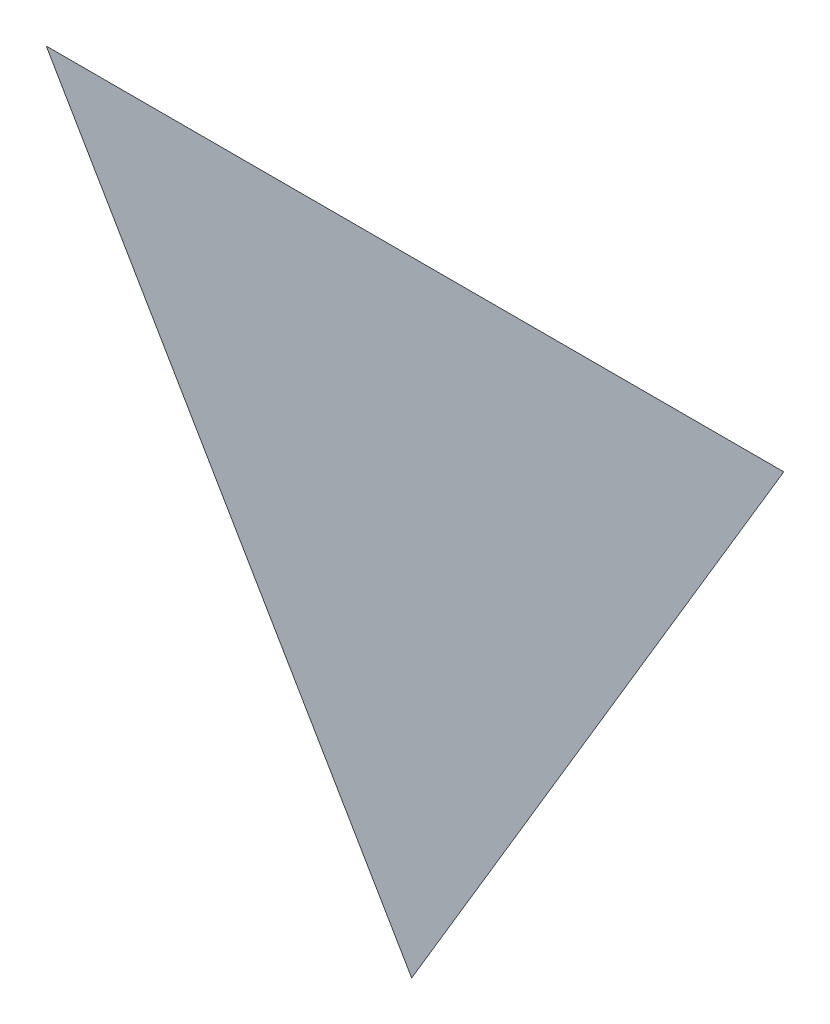
ISO-10303-21;
HEADER;
FILE_DESCRIPTION(('STEP AP214'),'2;1');
FILE_NAME('part.step','',(''),(''),'','','');
FILE_SCHEMA(('AUTOMOTIVE_DESIGN { 1 0 10303 214 1 1 1 1 }'));
ENDSEC;
DATA;
#1=APPLICATION_CONTEXT('core data for automotive mechanical design processes');
#2=APPLICATION_PROTOCOL_DEFINITION('international standard','automotive_design',2000,#1);
#3=PRODUCT_CONTEXT('',#1,'mechanical');
#4=PRODUCT('Part','Part','',(#3));
#5=PRODUCT_RELATED_PRODUCT_CATEGORY('part','',(#4));
#6=PRODUCT_DEFINITION_FORMATION('','',#4);
#7=PRODUCT_DEFINITION_CONTEXT('part definition',#1,'design');
#8=PRODUCT_DEFINITION('design','',#6,#7);
#9=PRODUCT_DEFINITION_SHAPE('','',#8);
#10=(LENGTH_UNIT() NAMED_UNIT(*) SI_UNIT(.MILLI.,.METRE.));
#11=(NAMED_UNIT(*) PLANE_ANGLE_UNIT() SI_UNIT($,.RADIAN.));
#12=(NAMED_UNIT(*) SI_UNIT($,.STERADIAN.) SOLID_ANGLE_UNIT());
#13=UNCERTAINTY_MEASURE_WITH_UNIT(LENGTH_MEASURE(1.E-05),#10,'distance_accuracy_value','');
#14=(GEOMETRIC_REPRESENTATION_CONTEXT(3) GLOBAL_UNCERTAINTY_ASSIGNED_CONTEXT((#13)) GLOBAL_UNIT_ASSIGNED_CONTEXT((#10,
#11,#12)) REPRESENTATION_CONTEXT('',''));
#15=CARTESIAN_POINT('',(0.,0.,0.));
#16=DIRECTION('',(0.,0.,1.));
#17=DIRECTION('',(1.,0.,0.));
#18=AXIS2_PLACEMENT_3D('',#15,#16,#17);
#19=CARTESIAN_POINT('',(-0.04524429343233,0.83895070403,0.00015));
#20=DIRECTION('',(0.,0.,1.));
#21=DIRECTION('',(1.,0.,0.));
#22=AXIS2_PLACEMENT_3D('',#19,#20,#21);
#23=PLANE('',#22);
#24=CARTESIAN_POINT('',(-0.01161339591565,0.895894323104,0.00015));
#25=DIRECTION('',(-1.,0.,0.));
#26=VECTOR('',#25,1.);
#27=LINE('',#24,#26);
#28=CARTESIAN_POINT('',(-0.01161339591565,0.895894323104,7.5E-05));
#29=VERTEX_POINT('',#28);
#30=CARTESIAN_POINT('',(-0.078875190949,0.895894323104,7.5E-05));
#31=VERTEX_POINT('',#30);
#32=EDGE_CURVE('E39',#29,#31,#27,.T.);
#33=ORIENTED_EDGE('',*,*,#32,.T.);
#34=CARTESIAN_POINT('',(-0.078875190949,0.895894323104,0.00015));
#35=DIRECTION('',(0.505103546368622,-0.863058750865688,0.));
#36=VECTOR('',#35,1.);
#37=LINE('',#34,#36);
#38=CARTESIAN_POINT('',(-0.04554904263234,0.83895070403,7.5E-05));
#39=VERTEX_POINT('',#38);
#40=EDGE_CURVE('E28',#31,#39,#37,.T.);
#41=ORIENTED_EDGE('',*,*,#40,.T.);
#42=CARTESIAN_POINT('',(-0.04554904263234,0.83895070403,0.00015));
#43=DIRECTION('',(0.511936422079954,0.859023340630495,0.));
#44=VECTOR('',#43,1.);
#45=LINE('',#42,#44);
#46=EDGE_CURVE('E11',#39,#29,#45,.T.);
#47=ORIENTED_EDGE('',*,*,#46,.T.);
#48=EDGE_LOOP('',(#33,#41,#47));
#49=FACE_BOUND('',#48,.T.);
#50=ADVANCED_FACE('F17',(#49),#23,.T.);
#51=CARTESIAN_POINT('',(-0.04524429343233,0.83895070403,0.));
#52=DIRECTION('',(0.,0.,1.));
#53=DIRECTION('',(1.,0.,0.));
#54=AXIS2_PLACEMENT_3D('',#51,#52,#53);
#55=PLANE('',#54);
#56=ORIENTED_EDGE('',*,*,#40,.F.);
#57=ORIENTED_EDGE('',*,*,#32,.F.);
#58=ORIENTED_EDGE('',*,*,#46,.F.);
#59=EDGE_LOOP('',(#56,#57,#58));
#60=FACE_BOUND('',#59,.T.);
#61=ADVANCED_FACE('F41',(#60),#55,.F.);
#62=CLOSED_SHELL('',(#50,#61));
#63=MANIFOLD_SOLID_BREP('B1',#62);
#64=ADVANCED_BREP_SHAPE_REPRESENTATION('',(#18,#63),#14);
#65=SHAPE_DEFINITION_REPRESENTATION(#9,#64);
ENDSEC;
END-ISO-10303-21;
